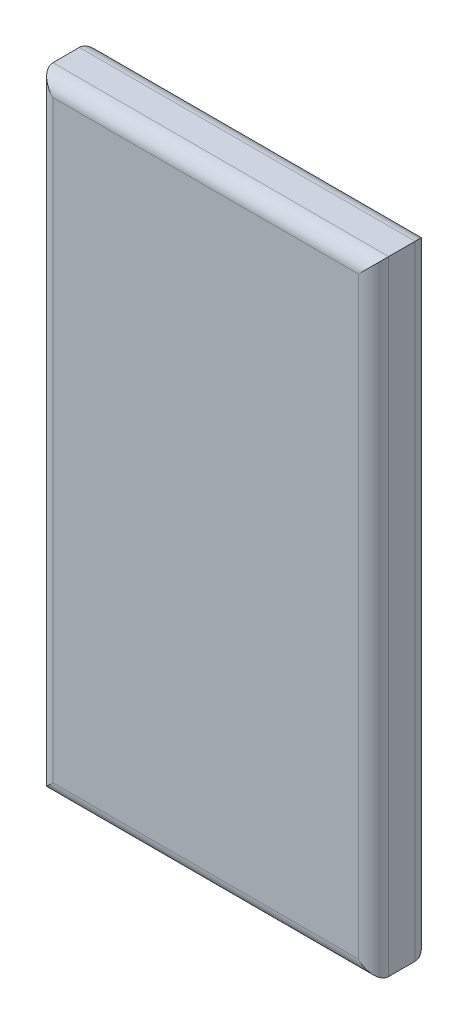
ISO-10303-21;
HEADER;
FILE_DESCRIPTION(('STEP AP214'),'2;1');
FILE_NAME('part.step','',(''),(''),'','','');
FILE_SCHEMA(('AUTOMOTIVE_DESIGN { 1 0 10303 214 1 1 1 1 }'));
ENDSEC;
DATA;
#1=APPLICATION_CONTEXT('core data for automotive mechanical design processes');
#2=APPLICATION_PROTOCOL_DEFINITION('international standard','automotive_design',2000,#1);
#3=PRODUCT_CONTEXT('',#1,'mechanical');
#4=PRODUCT('Part','Part','',(#3));
#5=PRODUCT_RELATED_PRODUCT_CATEGORY('part','',(#4));
#6=PRODUCT_DEFINITION_FORMATION('','',#4);
#7=PRODUCT_DEFINITION_CONTEXT('part definition',#1,'design');
#8=PRODUCT_DEFINITION('design','',#6,#7);
#9=PRODUCT_DEFINITION_SHAPE('','',#8);
#10=(LENGTH_UNIT() NAMED_UNIT(*) SI_UNIT(.MILLI.,.METRE.));
#11=(NAMED_UNIT(*) PLANE_ANGLE_UNIT() SI_UNIT($,.RADIAN.));
#12=(NAMED_UNIT(*) SI_UNIT($,.STERADIAN.) SOLID_ANGLE_UNIT());
#13=UNCERTAINTY_MEASURE_WITH_UNIT(LENGTH_MEASURE(1.E-05),#10,'distance_accuracy_value','');
#14=(GEOMETRIC_REPRESENTATION_CONTEXT(3) GLOBAL_UNCERTAINTY_ASSIGNED_CONTEXT((#13)) GLOBAL_UNIT_ASSIGNED_CONTEXT((#10,
#11,#12)) REPRESENTATION_CONTEXT('',''));
#15=CARTESIAN_POINT('',(0.,0.,0.));
#16=DIRECTION('',(0.,0.,1.));
#17=DIRECTION('',(1.,0.,0.));
#18=AXIS2_PLACEMENT_3D('',#15,#16,#17);
#19=CARTESIAN_POINT('',(0.,33.02,3.));
#20=DIRECTION('',(1.,0.,0.));
#21=DIRECTION('',(0.,0.,-1.));
#22=AXIS2_PLACEMENT_3D('',#19,#20,#21);
#23=PLANE('',#22);
#24=DIRECTION('',(0.,0.,-1.));
#25=VECTOR('',#24,1.);
#26=CARTESIAN_POINT('',(0.,33.02,3.));
#27=LINE('',#26,#25);
#28=CARTESIAN_POINT('',(0.,33.02,2.2));
#29=VERTEX_POINT('',#28);
#30=CARTESIAN_POINT('',(0.,33.02,0.8));
#31=VERTEX_POINT('',#30);
#32=EDGE_CURVE('E156',#29,#31,#27,.T.);
#33=ORIENTED_EDGE('',*,*,#32,.T.);
#34=DIRECTION('',(0.,-1.,0.));
#35=VECTOR('',#34,1.);
#36=CARTESIAN_POINT('',(0.,33.02,0.8));
#37=LINE('',#36,#35);
#38=CARTESIAN_POINT('',(0.,0.,0.8));
#39=VERTEX_POINT('',#38);
#40=EDGE_CURVE('E11',#31,#39,#37,.T.);
#41=ORIENTED_EDGE('',*,*,#40,.T.);
#42=DIRECTION('',(0.,0.,-1.));
#43=VECTOR('',#42,1.);
#44=CARTESIAN_POINT('',(0.,0.,3.));
#45=LINE('',#44,#43);
#46=CARTESIAN_POINT('',(0.,0.,2.2));
#47=VERTEX_POINT('',#46);
#48=EDGE_CURVE('E118',#47,#39,#45,.T.);
#49=ORIENTED_EDGE('',*,*,#48,.F.);
#50=DIRECTION('',(0.,-1.,0.));
#51=VECTOR('',#50,1.);
#52=CARTESIAN_POINT('',(0.,33.02,2.2));
#53=LINE('',#52,#51);
#54=EDGE_CURVE('E41',#47,#29,#53,.F.);
#55=ORIENTED_EDGE('',*,*,#54,.T.);
#56=EDGE_LOOP('',(#33,#41,#49,#55));
#57=FACE_BOUND('',#56,.T.);
#58=ADVANCED_FACE('F32',(#57),#23,.F.);
#59=CARTESIAN_POINT('',(0.,0.,3.));
#60=DIRECTION('',(0.,1.,0.));
#61=DIRECTION('',(0.,0.,1.));
#62=AXIS2_PLACEMENT_3D('',#59,#60,#61);
#63=PLANE('',#62);
#64=ORIENTED_EDGE('',*,*,#48,.T.);
#65=DIRECTION('',(1.,0.,0.));
#66=VECTOR('',#65,1.);
#67=CARTESIAN_POINT('',(0.,0.,0.8));
#68=LINE('',#67,#66);
#69=CARTESIAN_POINT('',(17.78,0.,0.8));
#70=VERTEX_POINT('',#69);
#71=EDGE_CURVE('E117',#39,#70,#68,.T.);
#72=ORIENTED_EDGE('',*,*,#71,.T.);
#73=DIRECTION('',(0.,0.,-1.));
#74=VECTOR('',#73,1.);
#75=CARTESIAN_POINT('',(17.78,0.,3.));
#76=LINE('',#75,#74);
#77=CARTESIAN_POINT('',(17.78,0.,2.2));
#78=VERTEX_POINT('',#77);
#79=EDGE_CURVE('E101',#78,#70,#76,.T.);
#80=ORIENTED_EDGE('',*,*,#79,.F.);
#81=DIRECTION('',(1.,0.,0.));
#82=VECTOR('',#81,1.);
#83=CARTESIAN_POINT('',(0.,0.,2.2));
#84=LINE('',#83,#82);
#85=EDGE_CURVE('E114',#78,#47,#84,.F.);
#86=ORIENTED_EDGE('',*,*,#85,.T.);
#87=EDGE_LOOP('',(#64,#72,#80,#86));
#88=FACE_BOUND('',#87,.T.);
#89=ADVANCED_FACE('F113',(#88),#63,.F.);
#90=CARTESIAN_POINT('',(17.78,33.02,3.));
#91=DIRECTION('',(-1.,0.,0.));
#92=DIRECTION('',(0.,-1.,0.));
#93=AXIS2_PLACEMENT_3D('',#90,#91,#92);
#94=PLANE('',#93);
#95=DIRECTION('',(0.,0.,-1.));
#96=VECTOR('',#95,1.);
#97=CARTESIAN_POINT('',(17.78,33.02,3.));
#98=LINE('',#97,#96);
#99=CARTESIAN_POINT('',(17.78,33.02,2.2));
#100=VERTEX_POINT('',#99);
#101=CARTESIAN_POINT('',(17.78,33.02,0.8));
#102=VERTEX_POINT('',#101);
#103=EDGE_CURVE('E102',#100,#102,#98,.T.);
#104=ORIENTED_EDGE('',*,*,#103,.F.);
#105=DIRECTION('',(0.,1.,0.));
#106=VECTOR('',#105,1.);
#107=CARTESIAN_POINT('',(17.78,0.,2.2));
#108=LINE('',#107,#106);
#109=EDGE_CURVE('E98',#100,#78,#108,.F.);
#110=ORIENTED_EDGE('',*,*,#109,.T.);
#111=ORIENTED_EDGE('',*,*,#79,.T.);
#112=DIRECTION('',(0.,1.,0.));
#113=VECTOR('',#112,1.);
#114=CARTESIAN_POINT('',(17.78,33.02,0.8));
#115=LINE('',#114,#113);
#116=EDGE_CURVE('E49',#70,#102,#115,.T.);
#117=ORIENTED_EDGE('',*,*,#116,.T.);
#118=EDGE_LOOP('',(#104,#110,#111,#117));
#119=FACE_BOUND('',#118,.T.);
#120=ADVANCED_FACE('F100',(#119),#94,.F.);
#121=CARTESIAN_POINT('',(0.,33.02,3.));
#122=DIRECTION('',(0.,-1.,0.));
#123=DIRECTION('',(0.,0.,-1.));
#124=AXIS2_PLACEMENT_3D('',#121,#122,#123);
#125=PLANE('',#124);
#126=ORIENTED_EDGE('',*,*,#103,.T.);
#127=DIRECTION('',(-1.,0.,0.));
#128=VECTOR('',#127,1.);
#129=CARTESIAN_POINT('',(0.,33.02,0.8));
#130=LINE('',#129,#128);
#131=EDGE_CURVE('E185',#102,#31,#130,.T.);
#132=ORIENTED_EDGE('',*,*,#131,.T.);
#133=ORIENTED_EDGE('',*,*,#32,.F.);
#134=DIRECTION('',(-1.,0.,0.));
#135=VECTOR('',#134,1.);
#136=CARTESIAN_POINT('',(17.78,33.02,2.2));
#137=LINE('',#136,#135);
#138=EDGE_CURVE('E56',#29,#100,#137,.F.);
#139=ORIENTED_EDGE('',*,*,#138,.T.);
#140=EDGE_LOOP('',(#126,#132,#133,#139));
#141=FACE_BOUND('',#140,.T.);
#142=ADVANCED_FACE('F187',(#141),#125,.F.);
#143=CARTESIAN_POINT('',(0.,0.,3.));
#144=DIRECTION('',(0.,0.,1.));
#145=DIRECTION('',(1.,0.,0.));
#146=AXIS2_PLACEMENT_3D('',#143,#144,#145);
#147=PLANE('',#146);
#148=DIRECTION('',(1.,0.,0.));
#149=VECTOR('',#148,1.);
#150=CARTESIAN_POINT('',(17.78,0.8,3.));
#151=LINE('',#150,#149);
#152=CARTESIAN_POINT('',(0.8,0.8,3.));
#153=VERTEX_POINT('',#152);
#154=CARTESIAN_POINT('',(16.98,0.8,3.));
#155=VERTEX_POINT('',#154);
#156=EDGE_CURVE('E181',#153,#155,#151,.T.);
#157=ORIENTED_EDGE('',*,*,#156,.T.);
#158=DIRECTION('',(0.,1.,0.));
#159=VECTOR('',#158,1.);
#160=CARTESIAN_POINT('',(16.98,33.02,3.));
#161=LINE('',#160,#159);
#162=CARTESIAN_POINT('',(16.98,32.22,3.));
#163=VERTEX_POINT('',#162);
#164=EDGE_CURVE('E130',#155,#163,#161,.T.);
#165=ORIENTED_EDGE('',*,*,#164,.T.);
#166=DIRECTION('',(-1.,0.,0.));
#167=VECTOR('',#166,1.);
#168=CARTESIAN_POINT('',(0.,32.22,3.));
#169=LINE('',#168,#167);
#170=CARTESIAN_POINT('',(0.8,32.22,3.));
#171=VERTEX_POINT('',#170);
#172=EDGE_CURVE('E179',#163,#171,#169,.T.);
#173=ORIENTED_EDGE('',*,*,#172,.T.);
#174=DIRECTION('',(0.,-1.,0.));
#175=VECTOR('',#174,1.);
#176=CARTESIAN_POINT('',(0.8,0.,3.));
#177=LINE('',#176,#175);
#178=EDGE_CURVE('E177',#171,#153,#177,.T.);
#179=ORIENTED_EDGE('',*,*,#178,.T.);
#180=EDGE_LOOP('',(#157,#165,#173,#179));
#181=FACE_BOUND('',#180,.T.);
#182=ADVANCED_FACE('F192',(#181),#147,.T.);
#183=CARTESIAN_POINT('',(0.,0.,0.));
#184=DIRECTION('',(0.,0.,1.));
#185=DIRECTION('',(1.,0.,0.));
#186=AXIS2_PLACEMENT_3D('',#183,#184,#185);
#187=PLANE('',#186);
#188=DIRECTION('',(-1.,0.,0.));
#189=VECTOR('',#188,1.);
#190=CARTESIAN_POINT('',(0.,32.22,0.));
#191=LINE('',#190,#189);
#192=CARTESIAN_POINT('',(0.8,32.22,0.));
#193=VERTEX_POINT('',#192);
#194=CARTESIAN_POINT('',(16.98,32.22,0.));
#195=VERTEX_POINT('',#194);
#196=EDGE_CURVE('E170',#193,#195,#191,.F.);
#197=ORIENTED_EDGE('',*,*,#196,.T.);
#198=DIRECTION('',(0.,1.,0.));
#199=VECTOR('',#198,1.);
#200=CARTESIAN_POINT('',(16.98,0.,0.));
#201=LINE('',#200,#199);
#202=CARTESIAN_POINT('',(16.98,0.8,0.));
#203=VERTEX_POINT('',#202);
#204=EDGE_CURVE('E175',#195,#203,#201,.F.);
#205=ORIENTED_EDGE('',*,*,#204,.T.);
#206=DIRECTION('',(1.,0.,0.));
#207=VECTOR('',#206,1.);
#208=CARTESIAN_POINT('',(0.,0.8,0.));
#209=LINE('',#208,#207);
#210=CARTESIAN_POINT('',(0.8,0.8,0.));
#211=VERTEX_POINT('',#210);
#212=EDGE_CURVE('E172',#203,#211,#209,.F.);
#213=ORIENTED_EDGE('',*,*,#212,.T.);
#214=DIRECTION('',(0.,-1.,0.));
#215=VECTOR('',#214,1.);
#216=CARTESIAN_POINT('',(0.8,0.,0.));
#217=LINE('',#216,#215);
#218=EDGE_CURVE('E168',#211,#193,#217,.F.);
#219=ORIENTED_EDGE('',*,*,#218,.T.);
#220=EDGE_LOOP('',(#197,#205,#213,#219));
#221=FACE_BOUND('',#220,.T.);
#222=ADVANCED_FACE('F220',(#221),#187,.F.);
#223=CARTESIAN_POINT('',(0.,32.22,0.8));
#224=DIRECTION('',(-1.,0.,0.));
#225=DIRECTION('',(0.,0.,1.));
#226=AXIS2_PLACEMENT_3D('',#223,#224,#225);
#227=CYLINDRICAL_SURFACE('',#226,0.8);
#228=CARTESIAN_POINT('',(16.98,32.22,0.8));
#229=DIRECTION('',(-0.707106781186548,0.707106781186547,0.));
#230=DIRECTION('',(0.707106781186547,0.707106781186548,0.));
#231=AXIS2_PLACEMENT_3D('',#228,#229,#230);
#232=ELLIPSE('',#231,1.13137084989848,0.8);
#233=EDGE_CURVE('E148',#195,#102,#232,.F.);
#234=ORIENTED_EDGE('',*,*,#233,.F.);
#235=ORIENTED_EDGE('',*,*,#196,.F.);
#236=CARTESIAN_POINT('',(0.8,32.22,0.8));
#237=DIRECTION('',(-0.707106781186547,-0.707106781186547,0.));
#238=DIRECTION('',(0.707106781186547,-0.707106781186547,0.));
#239=AXIS2_PLACEMENT_3D('',#236,#237,#238);
#240=ELLIPSE('',#239,1.13137084989848,0.8);
#241=EDGE_CURVE('E136',#31,#193,#240,.T.);
#242=ORIENTED_EDGE('',*,*,#241,.F.);
#243=ORIENTED_EDGE('',*,*,#131,.F.);
#244=EDGE_LOOP('',(#234,#235,#242,#243));
#245=FACE_BOUND('',#244,.T.);
#246=ADVANCED_FACE('F217',(#245),#227,.T.);
#247=CARTESIAN_POINT('',(0.8,33.02,0.8));
#248=DIRECTION('',(0.,-1.,0.));
#249=DIRECTION('',(0.,0.,-1.));
#250=AXIS2_PLACEMENT_3D('',#247,#248,#249);
#251=CYLINDRICAL_SURFACE('',#250,0.8);
#252=ORIENTED_EDGE('',*,*,#241,.T.);
#253=ORIENTED_EDGE('',*,*,#218,.F.);
#254=CARTESIAN_POINT('',(0.8,0.800000000000001,0.8));
#255=DIRECTION('',(0.707106781186547,-0.707106781186547,0.));
#256=DIRECTION('',(-0.707106781186547,-0.707106781186547,0.));
#257=AXIS2_PLACEMENT_3D('',#254,#255,#256);
#258=ELLIPSE('',#257,1.13137084989848,0.8);
#259=EDGE_CURVE('E143',#39,#211,#258,.T.);
#260=ORIENTED_EDGE('',*,*,#259,.F.);
#261=ORIENTED_EDGE('',*,*,#40,.F.);
#262=EDGE_LOOP('',(#252,#253,#260,#261));
#263=FACE_BOUND('',#262,.T.);
#264=ADVANCED_FACE('F214',(#263),#251,.T.);
#265=CARTESIAN_POINT('',(16.98,33.02,0.8));
#266=DIRECTION('',(0.,1.,0.));
#267=DIRECTION('',(-1.,0.,0.));
#268=AXIS2_PLACEMENT_3D('',#265,#266,#267);
#269=CYLINDRICAL_SURFACE('',#268,0.8);
#270=ORIENTED_EDGE('',*,*,#233,.T.);
#271=ORIENTED_EDGE('',*,*,#116,.F.);
#272=CARTESIAN_POINT('',(16.98,0.800000000000001,0.8));
#273=DIRECTION('',(0.707106781186547,0.707106781186548,0.));
#274=DIRECTION('',(-0.707106781186548,0.707106781186547,0.));
#275=AXIS2_PLACEMENT_3D('',#272,#273,#274);
#276=ELLIPSE('',#275,1.13137084989848,0.8);
#277=EDGE_CURVE('E139',#203,#70,#276,.F.);
#278=ORIENTED_EDGE('',*,*,#277,.F.);
#279=ORIENTED_EDGE('',*,*,#204,.F.);
#280=EDGE_LOOP('',(#270,#271,#278,#279));
#281=FACE_BOUND('',#280,.T.);
#282=ADVANCED_FACE('F211',(#281),#269,.T.);
#283=CARTESIAN_POINT('',(0.,0.8,0.8));
#284=DIRECTION('',(1.,0.,0.));
#285=DIRECTION('',(0.,0.,-1.));
#286=AXIS2_PLACEMENT_3D('',#283,#284,#285);
#287=CYLINDRICAL_SURFACE('',#286,0.8);
#288=ORIENTED_EDGE('',*,*,#259,.T.);
#289=ORIENTED_EDGE('',*,*,#212,.F.);
#290=ORIENTED_EDGE('',*,*,#277,.T.);
#291=ORIENTED_EDGE('',*,*,#71,.F.);
#292=EDGE_LOOP('',(#288,#289,#290,#291));
#293=FACE_BOUND('',#292,.T.);
#294=ADVANCED_FACE('F200',(#293),#287,.T.);
#295=CARTESIAN_POINT('',(0.,32.22,2.2));
#296=DIRECTION('',(1.,0.,0.));
#297=DIRECTION('',(0.,0.,-1.));
#298=AXIS2_PLACEMENT_3D('',#295,#296,#297);
#299=CYLINDRICAL_SURFACE('',#298,0.8);
#300=CARTESIAN_POINT('',(16.98,32.22,2.2));
#301=DIRECTION('',(0.707106781186548,-0.707106781186547,0.));
#302=DIRECTION('',(-0.707106781186547,-0.707106781186548,0.));
#303=AXIS2_PLACEMENT_3D('',#300,#301,#302);
#304=ELLIPSE('',#303,1.13137084989848,0.8);
#305=EDGE_CURVE('E133',#100,#163,#304,.T.);
#306=ORIENTED_EDGE('',*,*,#305,.F.);
#307=ORIENTED_EDGE('',*,*,#138,.F.);
#308=CARTESIAN_POINT('',(0.8,32.22,2.2));
#309=DIRECTION('',(0.707106781186547,0.707106781186547,0.));
#310=DIRECTION('',(-0.707106781186547,0.707106781186547,0.));
#311=AXIS2_PLACEMENT_3D('',#308,#309,#310);
#312=ELLIPSE('',#311,1.13137084989848,0.8);
#313=EDGE_CURVE('E36',#171,#29,#312,.F.);
#314=ORIENTED_EDGE('',*,*,#313,.F.);
#315=ORIENTED_EDGE('',*,*,#172,.F.);
#316=EDGE_LOOP('',(#306,#307,#314,#315));
#317=FACE_BOUND('',#316,.T.);
#318=ADVANCED_FACE('F34',(#317),#299,.T.);
#319=CARTESIAN_POINT('',(0.8,0.,2.2));
#320=DIRECTION('',(0.,1.,0.));
#321=DIRECTION('',(0.,0.,1.));
#322=AXIS2_PLACEMENT_3D('',#319,#320,#321);
#323=CYLINDRICAL_SURFACE('',#322,0.8);
#324=ORIENTED_EDGE('',*,*,#313,.T.);
#325=ORIENTED_EDGE('',*,*,#54,.F.);
#326=CARTESIAN_POINT('',(0.8,0.8,2.2));
#327=DIRECTION('',(-0.707106781186547,0.707106781186547,0.));
#328=DIRECTION('',(0.707106781186547,0.707106781186547,0.));
#329=AXIS2_PLACEMENT_3D('',#326,#327,#328);
#330=ELLIPSE('',#329,1.13137084989848,0.8);
#331=EDGE_CURVE('E126',#153,#47,#330,.F.);
#332=ORIENTED_EDGE('',*,*,#331,.F.);
#333=ORIENTED_EDGE('',*,*,#178,.F.);
#334=EDGE_LOOP('',(#324,#325,#332,#333));
#335=FACE_BOUND('',#334,.T.);
#336=ADVANCED_FACE('F193',(#335),#323,.T.);
#337=CARTESIAN_POINT('',(16.98,0.,2.2));
#338=DIRECTION('',(0.,-1.,0.));
#339=DIRECTION('',(1.,0.,0.));
#340=AXIS2_PLACEMENT_3D('',#337,#338,#339);
#341=CYLINDRICAL_SURFACE('',#340,0.8);
#342=ORIENTED_EDGE('',*,*,#305,.T.);
#343=ORIENTED_EDGE('',*,*,#164,.F.);
#344=CARTESIAN_POINT('',(16.98,0.8,2.2));
#345=DIRECTION('',(-0.707106781186547,-0.707106781186548,0.));
#346=DIRECTION('',(0.707106781186548,-0.707106781186547,0.));
#347=AXIS2_PLACEMENT_3D('',#344,#345,#346);
#348=ELLIPSE('',#347,1.13137084989848,0.8);
#349=EDGE_CURVE('E123',#78,#155,#348,.T.);
#350=ORIENTED_EDGE('',*,*,#349,.F.);
#351=ORIENTED_EDGE('',*,*,#109,.F.);
#352=EDGE_LOOP('',(#342,#343,#350,#351));
#353=FACE_BOUND('',#352,.T.);
#354=ADVANCED_FACE('F129',(#353),#341,.T.);
#355=CARTESIAN_POINT('',(0.,0.8,2.2));
#356=DIRECTION('',(-1.,0.,0.));
#357=DIRECTION('',(0.,0.,1.));
#358=AXIS2_PLACEMENT_3D('',#355,#356,#357);
#359=CYLINDRICAL_SURFACE('',#358,0.8);
#360=ORIENTED_EDGE('',*,*,#331,.T.);
#361=ORIENTED_EDGE('',*,*,#85,.F.);
#362=ORIENTED_EDGE('',*,*,#349,.T.);
#363=ORIENTED_EDGE('',*,*,#156,.F.);
#364=EDGE_LOOP('',(#360,#361,#362,#363));
#365=FACE_BOUND('',#364,.T.);
#366=ADVANCED_FACE('F121',(#365),#359,.T.);
#367=CLOSED_SHELL('',(#58,#89,#120,#142,#182,#222,#246,#264,#282,#294,#318,#336,#354,#366));
#368=MANIFOLD_SOLID_BREP('B2',#367);
#369=ADVANCED_BREP_SHAPE_REPRESENTATION('',(#18,#368),#14);
#370=SHAPE_DEFINITION_REPRESENTATION(#9,#369);
ENDSEC;
END-ISO-10303-21;
